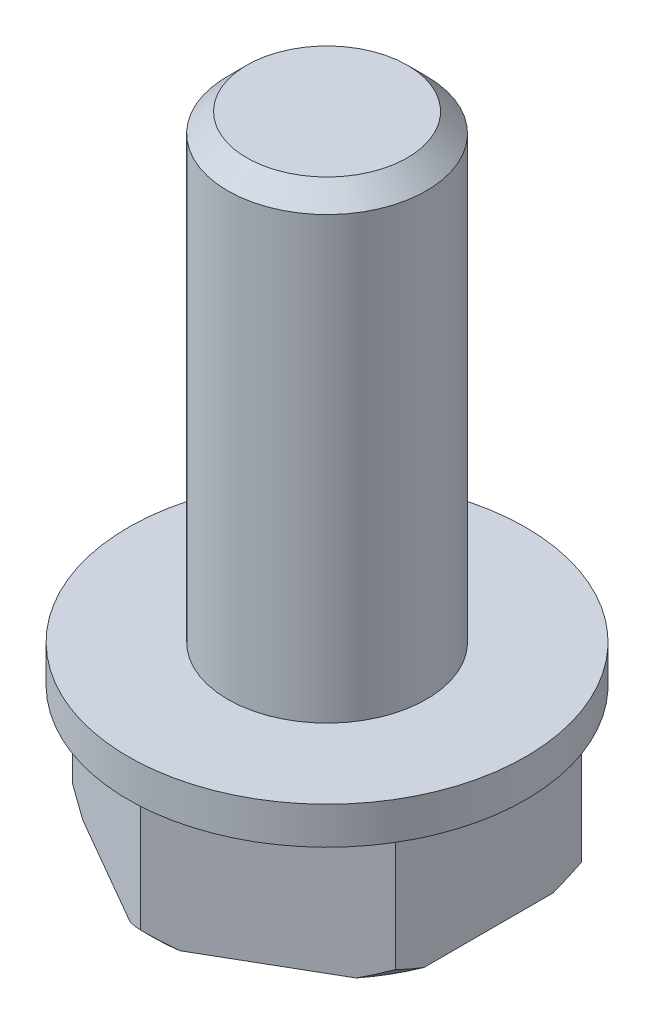
ISO-10303-21;
HEADER;
FILE_DESCRIPTION(('STEP AP214'),'2;1');
FILE_NAME('part.step','',(''),(''),'','','');
FILE_SCHEMA(('AUTOMOTIVE_DESIGN { 1 0 10303 214 1 1 1 1 }'));
ENDSEC;
DATA;
#1=APPLICATION_CONTEXT('core data for automotive mechanical design processes');
#2=APPLICATION_PROTOCOL_DEFINITION('international standard','automotive_design',2000,#1);
#3=PRODUCT_CONTEXT('',#1,'mechanical');
#4=PRODUCT('Part','Part','',(#3));
#5=PRODUCT_RELATED_PRODUCT_CATEGORY('part','',(#4));
#6=PRODUCT_DEFINITION_FORMATION('','',#4);
#7=PRODUCT_DEFINITION_CONTEXT('part definition',#1,'design');
#8=PRODUCT_DEFINITION('design','',#6,#7);
#9=PRODUCT_DEFINITION_SHAPE('','',#8);
#10=(LENGTH_UNIT() NAMED_UNIT(*) SI_UNIT(.MILLI.,.METRE.));
#11=(NAMED_UNIT(*) PLANE_ANGLE_UNIT() SI_UNIT($,.RADIAN.));
#12=(NAMED_UNIT(*) SI_UNIT($,.STERADIAN.) SOLID_ANGLE_UNIT());
#13=UNCERTAINTY_MEASURE_WITH_UNIT(LENGTH_MEASURE(1.E-05),#10,'distance_accuracy_value','');
#14=(GEOMETRIC_REPRESENTATION_CONTEXT(3) GLOBAL_UNCERTAINTY_ASSIGNED_CONTEXT((#13)) GLOBAL_UNIT_ASSIGNED_CONTEXT((#10,
#11,#12)) REPRESENTATION_CONTEXT('',''));
#15=CARTESIAN_POINT('',(0.,0.,0.));
#16=DIRECTION('',(0.,0.,1.));
#17=DIRECTION('',(1.,0.,0.));
#18=AXIS2_PLACEMENT_3D('',#15,#16,#17);
#19=CARTESIAN_POINT('',(-18.2487373415292,113.4,-28.5015140912618));
#20=DIRECTION('',(-0.5,0.,0.866025403784439));
#21=DIRECTION('',(0.866025403784439,0.,0.5));
#22=AXIS2_PLACEMENT_3D('',#19,#20,#21);
#23=PLANE('',#22);
#24=DIRECTION('',(0.,-1.,0.));
#25=VECTOR('',#24,1.);
#26=CARTESIAN_POINT('',(-18.2487373415292,113.4,-28.5015140912618));
#27=LINE('',#26,#25);
#28=CARTESIAN_POINT('',(-18.2487373415292,68.7,-28.5015140912618));
#29=VERTEX_POINT('',#28);
#30=CARTESIAN_POINT('',(-18.2487373415292,63.9055534994651,-28.5015140912618));
#31=VERTEX_POINT('',#30);
#32=EDGE_CURVE('E11',#29,#31,#27,.T.);
#33=ORIENTED_EDGE('',*,*,#32,.T.);
#34=CARTESIAN_POINT('',(-19.2487373415292,63.4,-29.0788643604513));
#35=CARTESIAN_POINT('',(-19.2075875044048,63.4176356350764,-29.0551063342587));
#36=CARTESIAN_POINT('',(-19.1665561132061,63.4356367332046,-29.0314154590603));
#37=CARTESIAN_POINT('',(-19.0843485750121,63.4725093452912,-28.9839491794677));
#38=CARTESIAN_POINT('',(-19.0431746303517,63.491387396993,-28.9601750378369));
#39=CARTESIAN_POINT('',(-18.9606612245202,63.5300136187559,-28.9125317923883));
#40=CARTESIAN_POINT('',(-18.9193241287219,63.5497685285905,-28.8886640603468));
#41=CARTESIAN_POINT('',(-18.8364645459509,63.5901483001101,-28.840822802906));
#42=CARTESIAN_POINT('',(-18.7949445731156,63.6107800529027,-28.8168507420988));
#43=CARTESIAN_POINT('',(-18.7117004687104,63.6529133663717,-28.7687901149625));
#44=CARTESIAN_POINT('',(-18.6699789875042,63.6744219220571,-28.7447030936522));
#45=CARTESIAN_POINT('',(-18.5863140898282,63.7183087773034,-28.6964018923307));
#46=CARTESIAN_POINT('',(-18.5443734460972,63.7406941334488,-28.6721893240107));
#47=CARTESIAN_POINT('',(-18.4602534517763,63.7863344571394,-28.6236265656998));
#48=CARTESIAN_POINT('',(-18.4180769827817,63.8095965033679,-28.5992780414191));
#49=CARTESIAN_POINT('',(-18.3334693927313,63.8569905234084,-28.5504330230577));
#50=CARTESIAN_POINT('',(-18.2910412469439,63.8811295690813,-28.5259382351502));
#51=CARTESIAN_POINT('',(-18.2487373415292,63.9055534994651,-28.5015140912617));
#52=B_SPLINE_CURVE_WITH_KNOTS('',3,(#34,#35,#36,#37,#38,#39,#40,#41,#42,#43,#44,#45,#46,#47,#48,
#49,#50,#51),.UNSPECIFIED.,.F.,.F.,(4,2,2,2,2,2,2,2,4),(0.,0.15204686609259,0.305507708751331,
0.460480357340252,0.617058082843112,0.775329645183761,0.935379361568319,1.0972871929665,
1.26112884592903),.UNSPECIFIED.);
#53=CARTESIAN_POINT('',(-19.2487373415291,63.4,-29.0788643604513));
#54=VERTEX_POINT('',#53);
#55=EDGE_CURVE('E320',#54,#31,#52,.T.);
#56=ORIENTED_EDGE('',*,*,#55,.F.);
#57=DIRECTION('',(0.866025403784439,0.,0.5));
#58=VECTOR('',#57,1.);
#59=CARTESIAN_POINT('',(-16.2487373415291,63.4,-27.3468135528825));
#60=LINE('',#59,#58);
#61=CARTESIAN_POINT('',(-23.7487373415292,63.4,-31.6769405718047));
#62=VERTEX_POINT('',#61);
#63=EDGE_CURVE('E414',#62,#54,#60,.T.);
#64=ORIENTED_EDGE('',*,*,#63,.F.);
#65=CARTESIAN_POINT('',(-24.7487373415292,63.9055534994651,-32.2542908409943));
#66=CARTESIAN_POINT('',(-24.7064334597487,63.8811295690813,-32.2298666561701));
#67=CARTESIAN_POINT('',(-24.6640062782667,63.8569905234084,-32.2053701980365));
#68=CARTESIAN_POINT('',(-24.5794014564922,63.8095965033679,-32.1565203848805));
#69=CARTESIAN_POINT('',(-24.5372267814232,63.7863344571393,-32.1321687534295));
#70=CARTESIAN_POINT('',(-24.4531102018876,63.7406941334488,-32.083600080537));
#71=CARTESIAN_POINT('',(-24.4111711807661,63.7183087773034,-32.0593847017748));
#72=CARTESIAN_POINT('',(-24.3275086645504,63.674421922057,-32.0110793756431));
#73=CARTESIAN_POINT('',(-24.2857879515911,63.6529133663717,-31.9869910236902));
#74=CARTESIAN_POINT('',(-24.2025441753667,63.6107800529026,-31.9389298281282));
#75=CARTESIAN_POINT('',(-24.1610237753089,63.5901483001101,-31.914958507292));
#76=CARTESIAN_POINT('',(-24.0781622396306,63.5497685285904,-31.8671206323857));
#77=CARTESIAN_POINT('',(-24.0368236294528,63.5300136187559,-31.8432555233265));
#78=CARTESIAN_POINT('',(-23.9543066656599,63.4913873969929,-31.7956184404479));
#79=CARTESIAN_POINT('',(-23.9131306827243,63.4725093452912,-31.7718478292134));
#80=CARTESIAN_POINT('',(-23.830919909677,63.4356367332046,-31.7243871525511));
#81=CARTESIAN_POINT('',(-23.7898873143179,63.4176356350764,-31.7006983630196));
#82=CARTESIAN_POINT('',(-23.7487373415292,63.4,-31.6769405718047));
#83=B_SPLINE_CURVE_WITH_KNOTS('',3,(#65,#66,#67,#68,#69,#70,#71,#72,#73,#74,#75,#76,#77,#78,#79,
#80,#81,#82),.UNSPECIFIED.,.F.,.F.,(4,2,2,2,2,2,2,2,4),(0.,0.163841652962572,0.325749484360786,
0.485799200745364,0.644070763086027,0.800648488588876,0.955621137177786,1.10908197983649,
1.26112884592904),.UNSPECIFIED.);
#84=CARTESIAN_POINT('',(-24.7487373415292,63.9055534994651,-32.2542908409943));
#85=VERTEX_POINT('',#84);
#86=EDGE_CURVE('E138',#85,#62,#83,.T.);
#87=ORIENTED_EDGE('',*,*,#86,.F.);
#88=DIRECTION('',(0.,-1.,0.));
#89=VECTOR('',#88,1.);
#90=CARTESIAN_POINT('',(-24.7487373415292,113.4,-32.2542908409943));
#91=LINE('',#90,#89);
#92=CARTESIAN_POINT('',(-24.7487373415292,68.7,-32.2542908409943));
#93=VERTEX_POINT('',#92);
#94=EDGE_CURVE('E392',#93,#85,#91,.T.);
#95=ORIENTED_EDGE('',*,*,#94,.F.);
#96=DIRECTION('',(-0.866025403784439,0.,-0.5));
#97=VECTOR('',#96,1.);
#98=CARTESIAN_POINT('',(-18.4987373415292,68.7,-28.6458516585592));
#99=LINE('',#98,#97);
#100=EDGE_CURVE('E147',#29,#93,#99,.T.);
#101=ORIENTED_EDGE('',*,*,#100,.F.);
#102=EDGE_LOOP('',(#33,#56,#64,#87,#95,#101));
#103=FACE_BOUND('',#102,.T.);
#104=ADVANCED_FACE('F16',(#103),#23,.F.);
#105=CARTESIAN_POINT('',(-18.2487373415292,113.4,-20.9959605917966));
#106=DIRECTION('',(-1.,0.,0.));
#107=DIRECTION('',(0.,0.,1.));
#108=AXIS2_PLACEMENT_3D('',#105,#106,#107);
#109=PLANE('',#108);
#110=DIRECTION('',(0.,-1.,0.));
#111=VECTOR('',#110,1.);
#112=CARTESIAN_POINT('',(-18.2487373415292,113.4,-20.9959605917966));
#113=LINE('',#112,#111);
#114=CARTESIAN_POINT('',(-18.2487373415292,68.7,-20.9959605917966));
#115=VERTEX_POINT('',#114);
#116=CARTESIAN_POINT('',(-18.2487373415292,63.9055534994651,-20.9959605917966));
#117=VERTEX_POINT('',#116);
#118=EDGE_CURVE('E144',#115,#117,#113,.T.);
#119=ORIENTED_EDGE('',*,*,#118,.T.);
#120=CARTESIAN_POINT('',(-18.2487373415292,63.4,-22.1506611301758));
#121=CARTESIAN_POINT('',(-18.2487374771936,63.4176356350764,-22.1031453127683));
#122=CARTESIAN_POINT('',(-18.248738681354,63.4356367332046,-22.0557656480384));
#123=CARTESIAN_POINT('',(-18.2487419162073,63.4725093452912,-21.9608386917834));
#124=CARTESIAN_POINT('',(-18.2487439544825,63.4913873969929,-21.9132939389182));
#125=CARTESIAN_POINT('',(-18.2487475124439,63.5300136187559,-21.8180136105911));
#126=CARTESIAN_POINT('',(-18.2487490268234,63.5497685285904,-21.7702807694903));
#127=CARTESIAN_POINT('',(-18.2487509797307,63.5901483001101,-21.6746016371432));
#128=CARTESIAN_POINT('',(-18.2487514069532,63.6107800529027,-21.6266582554998));
#129=CARTESIAN_POINT('',(-18.2487510787723,63.6529133663717,-21.5305364328015));
#130=CARTESIAN_POINT('',(-18.2487503105256,63.674421922057,-21.4823610595383));
#131=CARTESIAN_POINT('',(-18.2487479290653,63.7183087773034,-21.3857545320851));
#132=CARTESIAN_POINT('',(-18.2487463064557,63.7406941334488,-21.3373265850029));
#133=CARTESIAN_POINT('',(-18.2487428916704,63.7863344571393,-21.2401951537994));
#134=CARTESIAN_POINT('',(-18.2487410977448,63.8095965033679,-21.1914949980678));
#135=CARTESIAN_POINT('',(-18.2487383294689,63.8569905234084,-21.0938001665504));
#136=CARTESIAN_POINT('',(-18.2487373651634,63.8811295690813,-21.0448089205093));
#137=CARTESIAN_POINT('',(-18.2487373415292,63.9055534994651,-20.9959605917966));
#138=B_SPLINE_CURVE_WITH_KNOTS('',3,(#120,#121,#122,#123,#124,#125,#126,#127,#128,#129,#130,
#131,#132,#133,#134,#135,#136,#137),.UNSPECIFIED.,.F.,.F.,(4,2,2,2,2,2,2,2,4),(0.,
0.152046866092557,0.305507708751278,0.46048035734018,0.617058082843042,0.775329645183694,
0.935379361568268,1.09728719296648,1.26112884592904),.UNSPECIFIED.);
#139=CARTESIAN_POINT('',(-18.2487373415292,63.4,-22.1506611301759));
#140=VERTEX_POINT('',#139);
#141=EDGE_CURVE('E28',#140,#117,#138,.T.);
#142=ORIENTED_EDGE('',*,*,#141,.F.);
#143=DIRECTION('',(0.,0.,1.));
#144=VECTOR('',#143,1.);
#145=CARTESIAN_POINT('',(-18.2487373415292,63.4,-24.7487373415292));
#146=LINE('',#145,#144);
#147=CARTESIAN_POINT('',(-18.2487373415292,63.4,-27.3468135528825));
#148=VERTEX_POINT('',#147);
#149=EDGE_CURVE('E305',#148,#140,#146,.T.);
#150=ORIENTED_EDGE('',*,*,#149,.F.);
#151=CARTESIAN_POINT('',(-18.2487373415292,63.9055534994651,-28.5015140912618));
#152=CARTESIAN_POINT('',(-18.2487373415292,63.7175987189877,-28.125604530307));
#153=CARTESIAN_POINT('',(-18.2487373415292,63.5456736196058,-27.7393021691841));
#154=CARTESIAN_POINT('',(-18.2487373415292,63.4,-27.3468135528825));
#155=(BOUNDED_CURVE() B_SPLINE_CURVE(3,(#151,#152,#153,#154),.UNSPECIFIED.,.F.,
.F.) B_SPLINE_CURVE_WITH_KNOTS((4,4),(0.00544471025563386,0.00669711306648936),
.UNSPECIFIED.) CURVE() GEOMETRIC_REPRESENTATION_ITEM() RATIONAL_B_SPLINE_CURVE((1.,1.,1.,1.)) REPRESENTATION_ITEM(''));
#156=EDGE_CURVE('E363',#31,#148,#155,.T.);
#157=ORIENTED_EDGE('',*,*,#156,.F.);
#158=ORIENTED_EDGE('',*,*,#32,.F.);
#159=DIRECTION('',(0.,0.,-1.));
#160=VECTOR('',#159,1.);
#161=CARTESIAN_POINT('',(-18.2487373415292,68.7,-24.7487373415292));
#162=LINE('',#161,#160);
#163=EDGE_CURVE('E121',#115,#29,#162,.T.);
#164=ORIENTED_EDGE('',*,*,#163,.F.);
#165=EDGE_LOOP('',(#119,#142,#150,#157,#158,#164));
#166=FACE_BOUND('',#165,.T.);
#167=ADVANCED_FACE('F173',(#166),#109,.F.);
#168=CARTESIAN_POINT('',(-24.7487373415292,64.2,-24.7487373415292));
#169=DIRECTION('',(0.,1.,0.));
#170=DIRECTION('',(0.,0.,1.));
#171=AXIS2_PLACEMENT_3D('',#168,#169,#170);
#172=CONICAL_SURFACE('',#171,7.8,0.785398163397448);
#173=CARTESIAN_POINT('',(-24.7487373415292,63.4,-24.7487373415292));
#174=DIRECTION('',(0.,-1.,0.));
#175=DIRECTION('',(0.,0.,-1.));
#176=AXIS2_PLACEMENT_3D('',#173,#174,#175);
#177=CIRCLE('',#176,7.);
#178=CARTESIAN_POINT('',(-19.2487373415291,63.4,-20.4186103226069));
#179=VERTEX_POINT('',#178);
#180=EDGE_CURVE('E253',#140,#179,#177,.T.);
#181=ORIENTED_EDGE('',*,*,#180,.F.);
#182=ORIENTED_EDGE('',*,*,#141,.T.);
#183=CARTESIAN_POINT('',(-18.2487373415292,63.9055534994651,-20.9959605917966));
#184=CARTESIAN_POINT('',(-18.2910412469439,63.8811295690813,-20.9715364479081));
#185=CARTESIAN_POINT('',(-18.3334693927313,63.8569905234084,-20.9470416600005));
#186=CARTESIAN_POINT('',(-18.4180769827818,63.8095965033679,-20.8981966416391));
#187=CARTESIAN_POINT('',(-18.4602534517764,63.7863344571393,-20.8738481173585));
#188=CARTESIAN_POINT('',(-18.5443734460972,63.7406941334488,-20.8252853590476));
#189=CARTESIAN_POINT('',(-18.5863140898283,63.7183087773034,-20.8010727907276));
#190=CARTESIAN_POINT('',(-18.6699789875043,63.674421922057,-20.7527715894061));
#191=CARTESIAN_POINT('',(-18.7117004687104,63.6529133663717,-20.7286845680957));
#192=CARTESIAN_POINT('',(-18.7949445731156,63.6107800529027,-20.6806239409595));
#193=CARTESIAN_POINT('',(-18.8364645459509,63.5901483001101,-20.6566518801522));
#194=CARTESIAN_POINT('',(-18.919324128722,63.5497685285904,-20.6088106227114));
#195=CARTESIAN_POINT('',(-18.9606612245202,63.5300136187559,-20.5849428906699));
#196=CARTESIAN_POINT('',(-19.0431746303517,63.4913873969929,-20.5372996452214));
#197=CARTESIAN_POINT('',(-19.0843485750121,63.4725093452912,-20.5135255035906));
#198=CARTESIAN_POINT('',(-19.1665561132061,63.4356367332046,-20.466059223998));
#199=CARTESIAN_POINT('',(-19.2075875044049,63.4176356350764,-20.4423683487996));
#200=CARTESIAN_POINT('',(-19.2487373415292,63.4,-20.418610322607));
#201=B_SPLINE_CURVE_WITH_KNOTS('',3,(#183,#184,#185,#186,#187,#188,#189,#190,#191,#192,#193,
#194,#195,#196,#197,#198,#199,#200),.UNSPECIFIED.,.F.,.F.,(4,2,2,2,2,2,2,2,4),(0.,
0.163841652962557,0.325749484360762,0.485799200745331,0.644070763085982,0.800648488588841,
0.955621137177747,1.10908197983647,1.26112884592903),.UNSPECIFIED.);
#202=EDGE_CURVE('E195',#117,#179,#201,.T.);
#203=ORIENTED_EDGE('',*,*,#202,.T.);
#204=EDGE_LOOP('',(#181,#182,#203));
#205=FACE_BOUND('',#204,.T.);
#206=ADVANCED_FACE('F162',(#205),#172,.T.);
#207=CARTESIAN_POINT('',(-24.7487373415292,64.2,-24.7487373415292));
#208=DIRECTION('',(0.,1.,0.));
#209=DIRECTION('',(0.,0.,1.));
#210=AXIS2_PLACEMENT_3D('',#207,#208,#209);
#211=CONICAL_SURFACE('',#210,7.8,0.785398163397448);
#212=CARTESIAN_POINT('',(-24.7487373415292,63.4,-24.7487373415292));
#213=DIRECTION('',(0.,-1.,0.));
#214=DIRECTION('',(0.,0.,-1.));
#215=AXIS2_PLACEMENT_3D('',#212,#213,#214);
#216=CIRCLE('',#215,7.);
#217=EDGE_CURVE('E310',#54,#148,#216,.T.);
#218=ORIENTED_EDGE('',*,*,#217,.F.);
#219=ORIENTED_EDGE('',*,*,#55,.T.);
#220=ORIENTED_EDGE('',*,*,#156,.T.);
#221=EDGE_LOOP('',(#218,#219,#220));
#222=FACE_BOUND('',#221,.T.);
#223=ADVANCED_FACE('F172',(#222),#211,.T.);
#224=CARTESIAN_POINT('',(-24.7487373415292,64.2,-24.7487373415292));
#225=DIRECTION('',(0.,1.,0.));
#226=DIRECTION('',(0.,0.,1.));
#227=AXIS2_PLACEMENT_3D('',#224,#225,#226);
#228=CONICAL_SURFACE('',#227,7.8,0.785398163397448);
#229=CARTESIAN_POINT('',(-24.7487373415292,63.4,-24.7487373415292));
#230=DIRECTION('',(0.,-1.,0.));
#231=DIRECTION('',(0.,0.,-1.));
#232=AXIS2_PLACEMENT_3D('',#229,#230,#231);
#233=CIRCLE('',#232,7.);
#234=CARTESIAN_POINT('',(-25.7487373415292,63.4,-31.6769405718047));
#235=VERTEX_POINT('',#234);
#236=EDGE_CURVE('E418',#235,#62,#233,.T.);
#237=ORIENTED_EDGE('',*,*,#236,.F.);
#238=CARTESIAN_POINT('',(-25.7487373415292,63.4,-31.6769405718047));
#239=CARTESIAN_POINT('',(-25.7075873687404,63.4176356350764,-31.7006983630196));
#240=CARTESIAN_POINT('',(-25.6665547733813,63.4356367332046,-31.7243871525511));
#241=CARTESIAN_POINT('',(-25.584344000334,63.4725093452912,-31.7718478292134));
#242=CARTESIAN_POINT('',(-25.5431680173983,63.4913873969929,-31.7956184404479));
#243=CARTESIAN_POINT('',(-25.4606510536054,63.5300136187559,-31.8432555233265));
#244=CARTESIAN_POINT('',(-25.4193124434276,63.5497685285904,-31.8671206323857));
#245=CARTESIAN_POINT('',(-25.3364509077494,63.5901483001101,-31.914958507292));
#246=CARTESIAN_POINT('',(-25.2949305076916,63.6107800529027,-31.9389298281282));
#247=CARTESIAN_POINT('',(-25.2116867314672,63.6529133663717,-31.9869910236903));
#248=CARTESIAN_POINT('',(-25.1699660185078,63.6744219220571,-32.0110793756431));
#249=CARTESIAN_POINT('',(-25.0863035022921,63.7183087773034,-32.0593847017748));
#250=CARTESIAN_POINT('',(-25.0443644811706,63.7406941334488,-32.083600080537));
#251=CARTESIAN_POINT('',(-24.9602479016351,63.7863344571393,-32.1321687534296));
#252=CARTESIAN_POINT('',(-24.9180732265661,63.8095965033679,-32.1565203848805));
#253=CARTESIAN_POINT('',(-24.8334684047916,63.8569905234084,-32.2053701980365));
#254=CARTESIAN_POINT('',(-24.7910412233096,63.8811295690813,-32.2298666561701));
#255=CARTESIAN_POINT('',(-24.7487373415291,63.9055534994651,-32.2542908409943));
#256=B_SPLINE_CURVE_WITH_KNOTS('',3,(#238,#239,#240,#241,#242,#243,#244,#245,#246,#247,#248,
#249,#250,#251,#252,#253,#254,#255),.UNSPECIFIED.,.F.,.F.,(4,2,2,2,2,2,2,2,4),(0.,
0.152046866092583,0.305507708751318,0.460480357340236,0.617058082843102,0.775329645183757,
0.935379361568318,1.09728719296652,1.26112884592906),.UNSPECIFIED.);
#257=EDGE_CURVE('E511',#235,#85,#256,.T.);
#258=ORIENTED_EDGE('',*,*,#257,.T.);
#259=ORIENTED_EDGE('',*,*,#86,.T.);
#260=EDGE_LOOP('',(#237,#258,#259));
#261=FACE_BOUND('',#260,.T.);
#262=ADVANCED_FACE('F288',(#261),#228,.T.);
#263=CARTESIAN_POINT('',(-24.7487373415292,70.2,-24.7487373415292));
#264=DIRECTION('',(0.,-1.,0.));
#265=DIRECTION('',(0.,0.,-1.));
#266=AXIS2_PLACEMENT_3D('',#263,#264,#265);
#267=PLANE('',#266);
#268=CARTESIAN_POINT('',(-24.7487373415292,70.2,-24.7487373415292));
#269=DIRECTION('',(0.,-1.,0.));
#270=DIRECTION('',(0.,0.,-1.));
#271=AXIS2_PLACEMENT_3D('',#268,#269,#270);
#272=CIRCLE('',#271,4.);
#273=CARTESIAN_POINT('',(-24.7487373415292,70.2,-28.7487373415292));
#274=VERTEX_POINT('',#273);
#275=EDGE_CURVE('E119',#274,#274,#272,.T.);
#276=ORIENTED_EDGE('',*,*,#275,.T.);
#277=EDGE_LOOP('',(#276));
#278=FACE_BOUND('',#277,.T.);
#279=CARTESIAN_POINT('',(-24.7487373415292,70.2,-24.7487373415292));
#280=DIRECTION('',(0.,-1.,0.));
#281=DIRECTION('',(0.,0.,-1.));
#282=AXIS2_PLACEMENT_3D('',#279,#280,#281);
#283=CIRCLE('',#282,8.);
#284=CARTESIAN_POINT('',(-24.7487373415292,70.2,-32.7487373415291));
#285=VERTEX_POINT('',#284);
#286=EDGE_CURVE('E136',#285,#285,#283,.T.);
#287=ORIENTED_EDGE('',*,*,#286,.F.);
#288=EDGE_LOOP('',(#287));
#289=FACE_BOUND('',#288,.T.);
#290=ADVANCED_FACE('F285',(#278,#289),#267,.F.);
#291=CARTESIAN_POINT('',(-24.7487373415292,64.2,-24.7487373415292));
#292=DIRECTION('',(0.,1.,0.));
#293=DIRECTION('',(0.,0.,1.));
#294=AXIS2_PLACEMENT_3D('',#291,#292,#293);
#295=CONICAL_SURFACE('',#294,7.8,0.785398163397448);
#296=CARTESIAN_POINT('',(-24.7487373415292,63.4,-24.7487373415292));
#297=DIRECTION('',(0.,-1.,0.));
#298=DIRECTION('',(0.,0.,-1.));
#299=AXIS2_PLACEMENT_3D('',#296,#297,#298);
#300=CIRCLE('',#299,7.);
#301=CARTESIAN_POINT('',(-31.2487373415292,63.4,-27.3468135528825));
#302=VERTEX_POINT('',#301);
#303=CARTESIAN_POINT('',(-30.2487373415292,63.4,-29.0788643604513));
#304=VERTEX_POINT('',#303);
#305=EDGE_CURVE('E353',#302,#304,#300,.T.);
#306=ORIENTED_EDGE('',*,*,#305,.F.);
#307=CARTESIAN_POINT('',(-31.2487373415291,63.4,-27.3468135528825));
#308=CARTESIAN_POINT('',(-31.2487372058647,63.4176356350764,-27.39432937029));
#309=CARTESIAN_POINT('',(-31.2487360017043,63.4356367332046,-27.4417090350199));
#310=CARTESIAN_POINT('',(-31.248732766851,63.4725093452911,-27.5366359912748));
#311=CARTESIAN_POINT('',(-31.2487307285758,63.4913873969929,-27.5841807441401));
#312=CARTESIAN_POINT('',(-31.2487271706144,63.5300136187559,-27.6794610724672));
#313=CARTESIAN_POINT('',(-31.2487256562349,63.5497685285904,-27.7271939135679));
#314=CARTESIAN_POINT('',(-31.2487237033276,63.59014830011,-27.8228730459151));
#315=CARTESIAN_POINT('',(-31.2487232761051,63.6107800529026,-27.8708164275585));
#316=CARTESIAN_POINT('',(-31.248723604286,63.6529133663716,-27.9669382502568));
#317=CARTESIAN_POINT('',(-31.2487243725327,63.674421922057,-28.01511362352));
#318=CARTESIAN_POINT('',(-31.248726753993,63.7183087773034,-28.1117201509732));
#319=CARTESIAN_POINT('',(-31.2487283766026,63.7406941334487,-28.1601480980554));
#320=CARTESIAN_POINT('',(-31.2487317913879,63.7863344571393,-28.2572795292589));
#321=CARTESIAN_POINT('',(-31.2487335853135,63.8095965033679,-28.3059796849905));
#322=CARTESIAN_POINT('',(-31.2487363535894,63.8569905234084,-28.4036745165079));
#323=CARTESIAN_POINT('',(-31.2487373178949,63.8811295690813,-28.452665762549));
#324=CARTESIAN_POINT('',(-31.2487373415291,63.9055534994651,-28.5015140912617));
#325=B_SPLINE_CURVE_WITH_KNOTS('',3,(#307,#308,#309,#310,#311,#312,#313,#314,#315,#316,#317,
#318,#319,#320,#321,#322,#323,#324),.UNSPECIFIED.,.F.,.F.,(4,2,2,2,2,2,2,2,4),(0.,
0.152046866092541,0.30550770875124,0.460480357340139,0.617058082842995,0.775329645183659,
0.935379361568239,1.09728719296646,1.26112884592905),.UNSPECIFIED.);
#326=CARTESIAN_POINT('',(-31.2487373415292,63.9055534994651,-28.5015140912618));
#327=VERTEX_POINT('',#326);
#328=EDGE_CURVE('E468',#302,#327,#325,.T.);
#329=ORIENTED_EDGE('',*,*,#328,.T.);
#330=CARTESIAN_POINT('',(-31.2487373415291,63.9055534994651,-28.5015140912617));
#331=CARTESIAN_POINT('',(-31.2064334361144,63.8811295690813,-28.5259382351502));
#332=CARTESIAN_POINT('',(-31.164005290327,63.8569905234084,-28.5504330230578));
#333=CARTESIAN_POINT('',(-31.0793977002765,63.8095965033679,-28.5992780414192));
#334=CARTESIAN_POINT('',(-31.0372212312819,63.7863344571393,-28.6236265656998));
#335=CARTESIAN_POINT('',(-30.9531012369611,63.7406941334488,-28.6721893240107));
#336=CARTESIAN_POINT('',(-30.91116059323,63.7183087773034,-28.6964018923307));
#337=CARTESIAN_POINT('',(-30.827495695554,63.6744219220571,-28.7447030936522));
#338=CARTESIAN_POINT('',(-30.7857742143479,63.6529133663717,-28.7687901149626));
#339=CARTESIAN_POINT('',(-30.7025301099427,63.6107800529027,-28.8168507420988));
#340=CARTESIAN_POINT('',(-30.6610101371074,63.5901483001101,-28.8408228029061));
#341=CARTESIAN_POINT('',(-30.5781505543364,63.5497685285904,-28.8886640603469));
#342=CARTESIAN_POINT('',(-30.5368134585381,63.5300136187559,-28.9125317923884));
#343=CARTESIAN_POINT('',(-30.4543000527066,63.4913873969929,-28.9601750378369));
#344=CARTESIAN_POINT('',(-30.4131261080462,63.4725093452912,-28.9839491794677));
#345=CARTESIAN_POINT('',(-30.3309185698522,63.4356367332046,-29.0314154590603));
#346=CARTESIAN_POINT('',(-30.2898871786534,63.4176356350764,-29.0551063342587));
#347=CARTESIAN_POINT('',(-30.2487373415291,63.4,-29.0788643604513));
#348=B_SPLINE_CURVE_WITH_KNOTS('',3,(#330,#331,#332,#333,#334,#335,#336,#337,#338,#339,#340,
#341,#342,#343,#344,#345,#346,#347),.UNSPECIFIED.,.F.,.F.,(4,2,2,2,2,2,2,2,4),(0.,
0.163841652962558,0.325749484360756,0.485799200745324,0.644070763085981,0.800648488588841,
0.955621137177747,1.10908197983647,1.26112884592904),.UNSPECIFIED.);
#349=EDGE_CURVE('E139',#327,#304,#348,.T.);
#350=ORIENTED_EDGE('',*,*,#349,.T.);
#351=EDGE_LOOP('',(#306,#329,#350));
#352=FACE_BOUND('',#351,.T.);
#353=ADVANCED_FACE('F283',(#352),#295,.T.);
#354=CARTESIAN_POINT('',(-24.7487373415292,68.7,-24.7487373415292));
#355=DIRECTION('',(0.,-1.,0.));
#356=DIRECTION('',(0.,0.,-1.));
#357=AXIS2_PLACEMENT_3D('',#354,#355,#356);
#358=CYLINDRICAL_SURFACE('',#357,8.);
#359=ORIENTED_EDGE('',*,*,#286,.T.);
#360=EDGE_LOOP('',(#359));
#361=FACE_BOUND('',#360,.T.);
#362=CARTESIAN_POINT('',(-24.7487373415292,68.7,-24.7487373415292));
#363=DIRECTION('',(0.,-1.,0.));
#364=DIRECTION('',(0.,0.,-1.));
#365=AXIS2_PLACEMENT_3D('',#362,#363,#364);
#366=CIRCLE('',#365,8.);
#367=CARTESIAN_POINT('',(-24.7487373415292,68.7,-32.7487373415291));
#368=VERTEX_POINT('',#367);
#369=EDGE_CURVE('E130',#368,#368,#366,.T.);
#370=ORIENTED_EDGE('',*,*,#369,.F.);
#371=EDGE_LOOP('',(#370));
#372=FACE_BOUND('',#371,.T.);
#373=ADVANCED_FACE('F279',(#361,#372),#358,.T.);
#374=CARTESIAN_POINT('',(-24.7487373415292,113.4,-32.2542908409943));
#375=DIRECTION('',(0.5,0.,0.866025403784439));
#376=DIRECTION('',(0.866025403784439,0.,-0.5));
#377=AXIS2_PLACEMENT_3D('',#374,#375,#376);
#378=PLANE('',#377);
#379=ORIENTED_EDGE('',*,*,#94,.T.);
#380=ORIENTED_EDGE('',*,*,#257,.F.);
#381=DIRECTION('',(0.866025403784439,0.,-0.5));
#382=VECTOR('',#381,1.);
#383=CARTESIAN_POINT('',(-22.7487373415292,63.4,-33.4089913793736));
#384=LINE('',#383,#382);
#385=EDGE_CURVE('E421',#304,#235,#384,.T.);
#386=ORIENTED_EDGE('',*,*,#385,.F.);
#387=ORIENTED_EDGE('',*,*,#349,.F.);
#388=DIRECTION('',(0.,-1.,0.));
#389=VECTOR('',#388,1.);
#390=CARTESIAN_POINT('',(-31.2487373415292,113.4,-28.5015140912618));
#391=LINE('',#390,#389);
#392=CARTESIAN_POINT('',(-31.2487373415292,68.7,-28.5015140912618));
#393=VERTEX_POINT('',#392);
#394=EDGE_CURVE('E132',#393,#327,#391,.T.);
#395=ORIENTED_EDGE('',*,*,#394,.F.);
#396=DIRECTION('',(-0.866025403784439,0.,0.5));
#397=VECTOR('',#396,1.);
#398=CARTESIAN_POINT('',(-24.9987373415292,68.7,-32.1099532736969));
#399=LINE('',#398,#397);
#400=EDGE_CURVE('E135',#93,#393,#399,.T.);
#401=ORIENTED_EDGE('',*,*,#400,.F.);
#402=EDGE_LOOP('',(#379,#380,#386,#387,#395,#401));
#403=FACE_BOUND('',#402,.T.);
#404=ADVANCED_FACE('F282',(#403),#378,.F.);
#405=CARTESIAN_POINT('',(-31.2487373415292,113.4,-28.5015140912618));
#406=DIRECTION('',(1.,0.,0.));
#407=DIRECTION('',(0.,0.,-1.));
#408=AXIS2_PLACEMENT_3D('',#405,#406,#407);
#409=PLANE('',#408);
#410=ORIENTED_EDGE('',*,*,#394,.T.);
#411=ORIENTED_EDGE('',*,*,#328,.F.);
#412=DIRECTION('',(0.,0.,-1.));
#413=VECTOR('',#412,1.);
#414=CARTESIAN_POINT('',(-31.2487373415292,63.4,-24.7487373415292));
#415=LINE('',#414,#413);
#416=CARTESIAN_POINT('',(-31.2487373415292,63.4,-22.1506611301759));
#417=VERTEX_POINT('',#416);
#418=EDGE_CURVE('E345',#417,#302,#415,.T.);
#419=ORIENTED_EDGE('',*,*,#418,.F.);
#420=CARTESIAN_POINT('',(-31.2487373415292,63.9055534994651,-20.9959605917966));
#421=CARTESIAN_POINT('',(-31.2487373415292,63.7175987189877,-21.3718701527514));
#422=CARTESIAN_POINT('',(-31.2487373415292,63.5456736196058,-21.7581725138741));
#423=CARTESIAN_POINT('',(-31.2487373415292,63.4,-22.1506611301759));
#424=(BOUNDED_CURVE() B_SPLINE_CURVE(3,(#420,#421,#422,#423),.UNSPECIFIED.,.F.,
.F.) B_SPLINE_CURVE_WITH_KNOTS((4,4),(0.00544471025563386,0.00669711306648936),
.UNSPECIFIED.) CURVE() GEOMETRIC_REPRESENTATION_ITEM() RATIONAL_B_SPLINE_CURVE((1.,1.,1.,1.)) REPRESENTATION_ITEM(''));
#425=CARTESIAN_POINT('',(-31.2487373415292,63.9055534994651,-20.9959605917966));
#426=VERTEX_POINT('',#425);
#427=EDGE_CURVE('E123',#426,#417,#424,.T.);
#428=ORIENTED_EDGE('',*,*,#427,.F.);
#429=DIRECTION('',(0.,-1.,0.));
#430=VECTOR('',#429,1.);
#431=CARTESIAN_POINT('',(-31.2487373415292,113.4,-20.9959605917966));
#432=LINE('',#431,#430);
#433=CARTESIAN_POINT('',(-31.2487373415292,68.7,-20.9959605917966));
#434=VERTEX_POINT('',#433);
#435=EDGE_CURVE('E143',#434,#426,#432,.T.);
#436=ORIENTED_EDGE('',*,*,#435,.F.);
#437=DIRECTION('',(0.,0.,1.));
#438=VECTOR('',#437,1.);
#439=CARTESIAN_POINT('',(-31.2487373415292,68.7,-24.7487373415292));
#440=LINE('',#439,#438);
#441=EDGE_CURVE('E133',#393,#434,#440,.T.);
#442=ORIENTED_EDGE('',*,*,#441,.F.);
#443=EDGE_LOOP('',(#410,#411,#419,#428,#436,#442));
#444=FACE_BOUND('',#443,.T.);
#445=ADVANCED_FACE('F333',(#444),#409,.F.);
#446=CARTESIAN_POINT('',(-16.7487373415292,68.7,-24.7487373415292));
#447=DIRECTION('',(0.,1.,0.));
#448=DIRECTION('',(0.,0.,1.));
#449=AXIS2_PLACEMENT_3D('',#446,#447,#448);
#450=PLANE('',#449);
#451=ORIENTED_EDGE('',*,*,#369,.T.);
#452=EDGE_LOOP('',(#451));
#453=FACE_BOUND('',#452,.T.);
#454=ORIENTED_EDGE('',*,*,#163,.T.);
#455=ORIENTED_EDGE('',*,*,#100,.T.);
#456=ORIENTED_EDGE('',*,*,#400,.T.);
#457=ORIENTED_EDGE('',*,*,#441,.T.);
#458=DIRECTION('',(0.866025403784439,0.,0.5));
#459=VECTOR('',#458,1.);
#460=CARTESIAN_POINT('',(-24.9987373415292,68.7,-17.3875214093615));
#461=LINE('',#460,#459);
#462=CARTESIAN_POINT('',(-24.7487373415292,68.7,-17.243183842064));
#463=VERTEX_POINT('',#462);
#464=EDGE_CURVE('E126',#434,#463,#461,.T.);
#465=ORIENTED_EDGE('',*,*,#464,.T.);
#466=DIRECTION('',(0.866025403784439,0.,-0.5));
#467=VECTOR('',#466,1.);
#468=CARTESIAN_POINT('',(-18.4987373415292,68.7,-20.8516230244992));
#469=LINE('',#468,#467);
#470=EDGE_CURVE('E140',#463,#115,#469,.T.);
#471=ORIENTED_EDGE('',*,*,#470,.T.);
#472=EDGE_LOOP('',(#454,#455,#456,#457,#465,#471));
#473=FACE_BOUND('',#472,.T.);
#474=ADVANCED_FACE('F174',(#453,#473),#450,.F.);
#475=CARTESIAN_POINT('',(-24.7487373415292,88.7,-24.7487373415292));
#476=DIRECTION('',(0.,-1.,0.));
#477=DIRECTION('',(0.,0.,-1.));
#478=AXIS2_PLACEMENT_3D('',#475,#476,#477);
#479=CONICAL_SURFACE('',#478,3.233,0.78539816339745);
#480=CARTESIAN_POINT('',(-24.7487373415292,88.7,-24.7487373415292));
#481=DIRECTION('',(0.,-1.,0.));
#482=DIRECTION('',(0.,0.,-1.));
#483=AXIS2_PLACEMENT_3D('',#480,#481,#482);
#484=CIRCLE('',#483,3.233);
#485=CARTESIAN_POINT('',(-24.7487373415292,88.7,-27.9817373415292));
#486=VERTEX_POINT('',#485);
#487=EDGE_CURVE('E118',#486,#486,#484,.T.);
#488=ORIENTED_EDGE('',*,*,#487,.T.);
#489=EDGE_LOOP('',(#488));
#490=FACE_BOUND('',#489,.T.);
#491=CARTESIAN_POINT('',(-24.7487373415292,87.933,-24.7487373415292));
#492=DIRECTION('',(0.,-1.,0.));
#493=DIRECTION('',(0.,0.,-1.));
#494=AXIS2_PLACEMENT_3D('',#491,#492,#493);
#495=CIRCLE('',#494,4.);
#496=CARTESIAN_POINT('',(-24.7487373415292,87.933,-28.7487373415292));
#497=VERTEX_POINT('',#496);
#498=EDGE_CURVE('E115',#497,#497,#495,.T.);
#499=ORIENTED_EDGE('',*,*,#498,.F.);
#500=EDGE_LOOP('',(#499));
#501=FACE_BOUND('',#500,.T.);
#502=ADVANCED_FACE('F402',(#490,#501),#479,.T.);
#503=CARTESIAN_POINT('',(-24.7487373415292,88.7,-24.7487373415292));
#504=DIRECTION('',(0.,-1.,0.));
#505=DIRECTION('',(0.,0.,-1.));
#506=AXIS2_PLACEMENT_3D('',#503,#504,#505);
#507=PLANE('',#506);
#508=ORIENTED_EDGE('',*,*,#487,.F.);
#509=EDGE_LOOP('',(#508));
#510=FACE_BOUND('',#509,.T.);
#511=ADVANCED_FACE('F218',(#510),#507,.F.);
#512=CARTESIAN_POINT('',(-24.7487373415292,63.4,-24.7487373415292));
#513=DIRECTION('',(0.,-1.,0.));
#514=DIRECTION('',(0.,0.,-1.));
#515=AXIS2_PLACEMENT_3D('',#512,#513,#514);
#516=CYLINDRICAL_SURFACE('',#515,4.);
#517=ORIENTED_EDGE('',*,*,#498,.T.);
#518=EDGE_LOOP('',(#517));
#519=FACE_BOUND('',#518,.T.);
#520=ORIENTED_EDGE('',*,*,#275,.F.);
#521=EDGE_LOOP('',(#520));
#522=FACE_BOUND('',#521,.T.);
#523=ADVANCED_FACE('F18',(#519,#522),#516,.T.);
#524=CARTESIAN_POINT('',(-24.7487373415292,64.2,-24.7487373415292));
#525=DIRECTION('',(0.,1.,0.));
#526=DIRECTION('',(0.,0.,1.));
#527=AXIS2_PLACEMENT_3D('',#524,#525,#526);
#528=CONICAL_SURFACE('',#527,7.8,0.785398163397448);
#529=CARTESIAN_POINT('',(-24.7487373415292,63.4,-24.7487373415292));
#530=DIRECTION('',(0.,-1.,0.));
#531=DIRECTION('',(0.,0.,-1.));
#532=AXIS2_PLACEMENT_3D('',#529,#530,#531);
#533=CIRCLE('',#532,7.);
#534=CARTESIAN_POINT('',(-23.7487373415292,63.4,-17.8205341112537));
#535=VERTEX_POINT('',#534);
#536=CARTESIAN_POINT('',(-25.7487373415292,63.4,-17.8205341112537));
#537=VERTEX_POINT('',#536);
#538=EDGE_CURVE('E251',#535,#537,#533,.T.);
#539=ORIENTED_EDGE('',*,*,#538,.F.);
#540=CARTESIAN_POINT('',(-23.7487373415292,63.4,-17.8205341112537));
#541=CARTESIAN_POINT('',(-23.7898873143179,63.4176356350764,-17.7967763200387));
#542=CARTESIAN_POINT('',(-23.830919909677,63.4356367332046,-17.7730875305072));
#543=CARTESIAN_POINT('',(-23.9131306827244,63.4725093452912,-17.7256268538449));
#544=CARTESIAN_POINT('',(-23.95430666566,63.4913873969929,-17.7018562426104));
#545=CARTESIAN_POINT('',(-24.0368236294529,63.5300136187559,-17.6542191597318));
#546=CARTESIAN_POINT('',(-24.0781622396307,63.5497685285904,-17.6303540506726));
#547=CARTESIAN_POINT('',(-24.1610237753089,63.5901483001101,-17.5825161757663));
#548=CARTESIAN_POINT('',(-24.2025441753667,63.6107800529027,-17.5585448549301));
#549=CARTESIAN_POINT('',(-24.2857879515911,63.6529133663717,-17.510483659368));
#550=CARTESIAN_POINT('',(-24.3275086645504,63.6744219220571,-17.4863953074152));
#551=CARTESIAN_POINT('',(-24.4111711807662,63.7183087773034,-17.4380899812835));
#552=CARTESIAN_POINT('',(-24.4531102018877,63.7406941334488,-17.4138746025213));
#553=CARTESIAN_POINT('',(-24.5372267814232,63.7863344571393,-17.3653059296288));
#554=CARTESIAN_POINT('',(-24.5794014564922,63.8095965033679,-17.3409542981778));
#555=CARTESIAN_POINT('',(-24.6640062782667,63.8569905234084,-17.2921044850218));
#556=CARTESIAN_POINT('',(-24.7064334597487,63.8811295690813,-17.2676080268882));
#557=CARTESIAN_POINT('',(-24.7487373415292,63.9055534994651,-17.243183842064));
#558=B_SPLINE_CURVE_WITH_KNOTS('',3,(#540,#541,#542,#543,#544,#545,#546,#547,#548,#549,#550,
#551,#552,#553,#554,#555,#556,#557),.UNSPECIFIED.,.F.,.F.,(4,2,2,2,2,2,2,2,4),(0.,
0.152046866092578,0.305507708751303,0.460480357340219,0.617058082843075,0.775329645183732,
0.935379361568292,1.09728719296649,1.26112884592903),.UNSPECIFIED.);
#559=CARTESIAN_POINT('',(-24.7487373415292,63.9055534994651,-17.243183842064));
#560=VERTEX_POINT('',#559);
#561=EDGE_CURVE('E238',#535,#560,#558,.T.);
#562=ORIENTED_EDGE('',*,*,#561,.T.);
#563=CARTESIAN_POINT('',(-24.7487373415291,63.9055534994651,-17.243183842064));
#564=CARTESIAN_POINT('',(-24.7910412233096,63.8811295690813,-17.2676080268882));
#565=CARTESIAN_POINT('',(-24.8334684047916,63.8569905234084,-17.2921044850218));
#566=CARTESIAN_POINT('',(-24.9180732265661,63.8095965033679,-17.3409542981778));
#567=CARTESIAN_POINT('',(-24.9602479016351,63.7863344571393,-17.3653059296287));
#568=CARTESIAN_POINT('',(-25.0443644811706,63.7406941334488,-17.4138746025213));
#569=CARTESIAN_POINT('',(-25.0863035022921,63.7183087773034,-17.4380899812835));
#570=CARTESIAN_POINT('',(-25.1699660185079,63.6744219220571,-17.4863953074152));
#571=CARTESIAN_POINT('',(-25.2116867314672,63.6529133663717,-17.510483659368));
#572=CARTESIAN_POINT('',(-25.2949305076916,63.6107800529027,-17.5585448549301));
#573=CARTESIAN_POINT('',(-25.3364509077494,63.5901483001101,-17.5825161757663));
#574=CARTESIAN_POINT('',(-25.4193124434277,63.5497685285904,-17.6303540506726));
#575=CARTESIAN_POINT('',(-25.4606510536055,63.5300136187559,-17.6542191597318));
#576=CARTESIAN_POINT('',(-25.5431680173984,63.4913873969929,-17.7018562426104));
#577=CARTESIAN_POINT('',(-25.584344000334,63.4725093452912,-17.7256268538449));
#578=CARTESIAN_POINT('',(-25.6665547733813,63.4356367332046,-17.7730875305072));
#579=CARTESIAN_POINT('',(-25.7075873687404,63.4176356350764,-17.7967763200387));
#580=CARTESIAN_POINT('',(-25.7487373415292,63.4,-17.8205341112537));
#581=B_SPLINE_CURVE_WITH_KNOTS('',3,(#563,#564,#565,#566,#567,#568,#569,#570,#571,#572,#573,
#574,#575,#576,#577,#578,#579,#580),.UNSPECIFIED.,.F.,.F.,(4,2,2,2,2,2,2,2,4),(0.,
0.163841652962565,0.325749484360773,0.485799200745343,0.644070763086013,0.80064848858887,
0.955621137177784,1.10908197983651,1.26112884592907),.UNSPECIFIED.);
#582=EDGE_CURVE('E129',#560,#537,#581,.T.);
#583=ORIENTED_EDGE('',*,*,#582,.T.);
#584=EDGE_LOOP('',(#539,#562,#583));
#585=FACE_BOUND('',#584,.T.);
#586=ADVANCED_FACE('F211',(#585),#528,.T.);
#587=CARTESIAN_POINT('',(-24.7487373415292,64.2,-24.7487373415292));
#588=DIRECTION('',(0.,1.,0.));
#589=DIRECTION('',(0.,0.,1.));
#590=AXIS2_PLACEMENT_3D('',#587,#588,#589);
#591=CONICAL_SURFACE('',#590,7.8,0.785398163397448);
#592=CARTESIAN_POINT('',(-30.2487373415291,63.4,-20.4186103226069));
#593=CARTESIAN_POINT('',(-30.2898871786534,63.4176356350764,-20.4423683487996));
#594=CARTESIAN_POINT('',(-30.3309185698522,63.4356367332046,-20.466059223998));
#595=CARTESIAN_POINT('',(-30.4131261080462,63.4725093452912,-20.5135255035906));
#596=CARTESIAN_POINT('',(-30.4543000527066,63.491387396993,-20.5372996452214));
#597=CARTESIAN_POINT('',(-30.5368134585381,63.5300136187559,-20.5849428906699));
#598=CARTESIAN_POINT('',(-30.5781505543364,63.5497685285905,-20.6088106227114));
#599=CARTESIAN_POINT('',(-30.6610101371074,63.5901483001101,-20.6566518801523));
#600=CARTESIAN_POINT('',(-30.7025301099427,63.6107800529027,-20.6806239409595));
#601=CARTESIAN_POINT('',(-30.7857742143479,63.6529133663717,-20.7286845680957));
#602=CARTESIAN_POINT('',(-30.8274956955541,63.6744219220571,-20.7527715894061));
#603=CARTESIAN_POINT('',(-30.9111605932301,63.7183087773034,-20.8010727907276));
#604=CARTESIAN_POINT('',(-30.9531012369611,63.7406941334488,-20.8252853590476));
#605=CARTESIAN_POINT('',(-31.037221231282,63.7863344571394,-20.8738481173585));
#606=CARTESIAN_POINT('',(-31.0793977002766,63.8095965033679,-20.8981966416392));
#607=CARTESIAN_POINT('',(-31.164005290327,63.8569905234084,-20.9470416600006));
#608=CARTESIAN_POINT('',(-31.2064334361144,63.8811295690813,-20.9715364479081));
#609=CARTESIAN_POINT('',(-31.2487373415291,63.9055534994651,-20.9959605917966));
#610=B_SPLINE_CURVE_WITH_KNOTS('',3,(#592,#593,#594,#595,#596,#597,#598,#599,#600,#601,#602,
#603,#604,#605,#606,#607,#608,#609),.UNSPECIFIED.,.F.,.F.,(4,2,2,2,2,2,2,2,4),(0.,
0.152046866092599,0.305507708751347,0.460480357340272,0.617058082843147,0.775329645183796,
0.935379361568359,1.09728719296653,1.26112884592906),.UNSPECIFIED.);
#611=CARTESIAN_POINT('',(-30.2487373415292,63.4,-20.4186103226069));
#612=VERTEX_POINT('',#611);
#613=EDGE_CURVE('E259',#612,#426,#610,.T.);
#614=ORIENTED_EDGE('',*,*,#613,.T.);
#615=ORIENTED_EDGE('',*,*,#427,.T.);
#616=CARTESIAN_POINT('',(-24.7487373415292,63.4,-24.7487373415292));
#617=DIRECTION('',(0.,-1.,0.));
#618=DIRECTION('',(0.,0.,-1.));
#619=AXIS2_PLACEMENT_3D('',#616,#617,#618);
#620=CIRCLE('',#619,7.);
#621=EDGE_CURVE('E128',#612,#417,#620,.T.);
#622=ORIENTED_EDGE('',*,*,#621,.F.);
#623=EDGE_LOOP('',(#614,#615,#622));
#624=FACE_BOUND('',#623,.T.);
#625=ADVANCED_FACE('F216',(#624),#591,.T.);
#626=CARTESIAN_POINT('',(-17.7487373415292,63.4,-24.7487373415292));
#627=DIRECTION('',(0.,1.,0.));
#628=DIRECTION('',(0.,0.,1.));
#629=AXIS2_PLACEMENT_3D('',#626,#627,#628);
#630=PLANE('',#629);
#631=ORIENTED_EDGE('',*,*,#621,.T.);
#632=ORIENTED_EDGE('',*,*,#418,.T.);
#633=ORIENTED_EDGE('',*,*,#305,.T.);
#634=ORIENTED_EDGE('',*,*,#385,.T.);
#635=ORIENTED_EDGE('',*,*,#236,.T.);
#636=ORIENTED_EDGE('',*,*,#63,.T.);
#637=ORIENTED_EDGE('',*,*,#217,.T.);
#638=ORIENTED_EDGE('',*,*,#149,.T.);
#639=ORIENTED_EDGE('',*,*,#180,.T.);
#640=DIRECTION('',(-0.866025403784439,0.,0.5));
#641=VECTOR('',#640,1.);
#642=CARTESIAN_POINT('',(-16.2487373415291,63.4,-22.1506611301759));
#643=LINE('',#642,#641);
#644=EDGE_CURVE('E199',#179,#535,#643,.T.);
#645=ORIENTED_EDGE('',*,*,#644,.T.);
#646=ORIENTED_EDGE('',*,*,#538,.T.);
#647=DIRECTION('',(-0.866025403784439,0.,-0.5));
#648=VECTOR('',#647,1.);
#649=CARTESIAN_POINT('',(-22.7487373415292,63.4,-16.0884833036848));
#650=LINE('',#649,#648);
#651=EDGE_CURVE('E256',#537,#612,#650,.T.);
#652=ORIENTED_EDGE('',*,*,#651,.T.);
#653=EDGE_LOOP('',(#631,#632,#633,#634,#635,#636,#637,#638,#639,#645,#646,#652));
#654=FACE_BOUND('',#653,.T.);
#655=ADVANCED_FACE('F176',(#654),#630,.F.);
#656=CARTESIAN_POINT('',(-31.2487373415292,113.4,-20.9959605917966));
#657=DIRECTION('',(0.5,0.,-0.866025403784439));
#658=DIRECTION('',(-0.866025403784439,0.,-0.5));
#659=AXIS2_PLACEMENT_3D('',#656,#657,#658);
#660=PLANE('',#659);
#661=ORIENTED_EDGE('',*,*,#435,.T.);
#662=ORIENTED_EDGE('',*,*,#613,.F.);
#663=ORIENTED_EDGE('',*,*,#651,.F.);
#664=ORIENTED_EDGE('',*,*,#582,.F.);
#665=DIRECTION('',(0.,-1.,0.));
#666=VECTOR('',#665,1.);
#667=CARTESIAN_POINT('',(-24.7487373415292,113.4,-17.243183842064));
#668=LINE('',#667,#666);
#669=EDGE_CURVE('E242',#463,#560,#668,.T.);
#670=ORIENTED_EDGE('',*,*,#669,.F.);
#671=ORIENTED_EDGE('',*,*,#464,.F.);
#672=EDGE_LOOP('',(#661,#662,#663,#664,#670,#671));
#673=FACE_BOUND('',#672,.T.);
#674=ADVANCED_FACE('F210',(#673),#660,.F.);
#675=CARTESIAN_POINT('',(-24.7487373415292,113.4,-17.243183842064));
#676=DIRECTION('',(-0.5,0.,-0.866025403784439));
#677=DIRECTION('',(-0.866025403784439,0.,0.5));
#678=AXIS2_PLACEMENT_3D('',#675,#676,#677);
#679=PLANE('',#678);
#680=ORIENTED_EDGE('',*,*,#669,.T.);
#681=ORIENTED_EDGE('',*,*,#561,.F.);
#682=ORIENTED_EDGE('',*,*,#644,.F.);
#683=ORIENTED_EDGE('',*,*,#202,.F.);
#684=ORIENTED_EDGE('',*,*,#118,.F.);
#685=ORIENTED_EDGE('',*,*,#470,.F.);
#686=EDGE_LOOP('',(#680,#681,#682,#683,#684,#685));
#687=FACE_BOUND('',#686,.T.);
#688=ADVANCED_FACE('F201',(#687),#679,.F.);
#689=CLOSED_SHELL('',(#104,#167,#206,#223,#262,#290,#353,#373,#404,#445,#474,#502,#511,#523,
#586,#625,#655,#674,#688));
#690=MANIFOLD_SOLID_BREP('B1',#689);
#691=ADVANCED_BREP_SHAPE_REPRESENTATION('',(#18,#690),#14);
#692=SHAPE_DEFINITION_REPRESENTATION(#9,#691);
ENDSEC;
END-ISO-10303-21;
